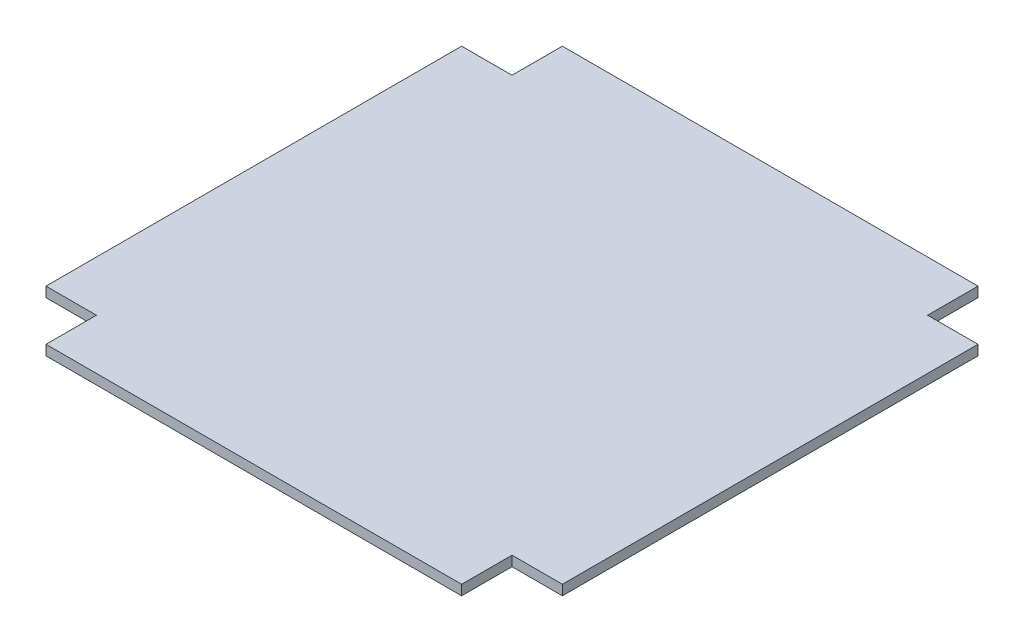
ISO-10303-21;
HEADER;
FILE_DESCRIPTION(('STEP AP214'),'2;1');
FILE_NAME('part.step','',(''),(''),'','','');
FILE_SCHEMA(('AUTOMOTIVE_DESIGN { 1 0 10303 214 1 1 1 1 }'));
ENDSEC;
DATA;
#1=APPLICATION_CONTEXT('core data for automotive mechanical design processes');
#2=APPLICATION_PROTOCOL_DEFINITION('international standard','automotive_design',2000,#1);
#3=PRODUCT_CONTEXT('',#1,'mechanical');
#4=PRODUCT('Part','Part','',(#3));
#5=PRODUCT_RELATED_PRODUCT_CATEGORY('part','',(#4));
#6=PRODUCT_DEFINITION_FORMATION('','',#4);
#7=PRODUCT_DEFINITION_CONTEXT('part definition',#1,'design');
#8=PRODUCT_DEFINITION('design','',#6,#7);
#9=PRODUCT_DEFINITION_SHAPE('','',#8);
#10=(LENGTH_UNIT() NAMED_UNIT(*) SI_UNIT(.MILLI.,.METRE.));
#11=(NAMED_UNIT(*) PLANE_ANGLE_UNIT() SI_UNIT($,.RADIAN.));
#12=(NAMED_UNIT(*) SI_UNIT($,.STERADIAN.) SOLID_ANGLE_UNIT());
#13=UNCERTAINTY_MEASURE_WITH_UNIT(LENGTH_MEASURE(1.E-05),#10,'distance_accuracy_value','');
#14=(GEOMETRIC_REPRESENTATION_CONTEXT(3) GLOBAL_UNCERTAINTY_ASSIGNED_CONTEXT((#13)) GLOBAL_UNIT_ASSIGNED_CONTEXT((#10,
#11,#12)) REPRESENTATION_CONTEXT('',''));
#15=CARTESIAN_POINT('',(0.,0.,0.));
#16=DIRECTION('',(0.,0.,1.));
#17=DIRECTION('',(1.,0.,0.));
#18=AXIS2_PLACEMENT_3D('',#15,#16,#17);
#19=CARTESIAN_POINT('',(0.,4.,-82.9));
#20=DIRECTION('',(0.,0.,-1.));
#21=DIRECTION('',(-1.,0.,0.));
#22=AXIS2_PLACEMENT_3D('',#19,#20,#21);
#23=PLANE('',#22);
#24=DIRECTION('',(1.,0.,0.));
#25=VECTOR('',#24,1.);
#26=CARTESIAN_POINT('',(0.,0.,-82.9));
#27=LINE('',#26,#25);
#28=CARTESIAN_POINT('',(-103.,0.,-82.9));
#29=VERTEX_POINT('',#28);
#30=CARTESIAN_POINT('',(-82.9,0.,-82.9));
#31=VERTEX_POINT('',#30);
#32=EDGE_CURVE('E153',#29,#31,#27,.T.);
#33=ORIENTED_EDGE('',*,*,#32,.F.);
#34=DIRECTION('',(0.,-1.,0.));
#35=VECTOR('',#34,1.);
#36=CARTESIAN_POINT('',(-103.,4.,-82.9));
#37=LINE('',#36,#35);
#38=CARTESIAN_POINT('',(-103.,4.,-82.9));
#39=VERTEX_POINT('',#38);
#40=EDGE_CURVE('E11',#39,#29,#37,.T.);
#41=ORIENTED_EDGE('',*,*,#40,.F.);
#42=DIRECTION('',(1.,0.,0.));
#43=VECTOR('',#42,1.);
#44=CARTESIAN_POINT('',(0.,4.,-82.9));
#45=LINE('',#44,#43);
#46=CARTESIAN_POINT('',(-82.9,4.,-82.9));
#47=VERTEX_POINT('',#46);
#48=EDGE_CURVE('E183',#39,#47,#45,.T.);
#49=ORIENTED_EDGE('',*,*,#48,.T.);
#50=DIRECTION('',(0.,-1.,0.));
#51=VECTOR('',#50,1.);
#52=CARTESIAN_POINT('',(-82.9,4.,-82.9));
#53=LINE('',#52,#51);
#54=EDGE_CURVE('E99',#47,#31,#53,.T.);
#55=ORIENTED_EDGE('',*,*,#54,.T.);
#56=EDGE_LOOP('',(#33,#41,#49,#55));
#57=FACE_BOUND('',#56,.T.);
#58=ADVANCED_FACE('F37',(#57),#23,.T.);
#59=CARTESIAN_POINT('',(-103.,4.,0.));
#60=DIRECTION('',(-1.,0.,0.));
#61=DIRECTION('',(0.,0.,1.));
#62=AXIS2_PLACEMENT_3D('',#59,#60,#61);
#63=PLANE('',#62);
#64=DIRECTION('',(0.,0.,-1.));
#65=VECTOR('',#64,1.);
#66=CARTESIAN_POINT('',(-103.,0.,0.));
#67=LINE('',#66,#65);
#68=CARTESIAN_POINT('',(-103.,0.,82.9));
#69=VERTEX_POINT('',#68);
#70=EDGE_CURVE('E156',#69,#29,#67,.T.);
#71=ORIENTED_EDGE('',*,*,#70,.F.);
#72=DIRECTION('',(0.,-1.,0.));
#73=VECTOR('',#72,1.);
#74=CARTESIAN_POINT('',(-103.,4.,82.9));
#75=LINE('',#74,#73);
#76=CARTESIAN_POINT('',(-103.,4.,82.9));
#77=VERTEX_POINT('',#76);
#78=EDGE_CURVE('E45',#77,#69,#75,.T.);
#79=ORIENTED_EDGE('',*,*,#78,.F.);
#80=DIRECTION('',(0.,0.,-1.));
#81=VECTOR('',#80,1.);
#82=CARTESIAN_POINT('',(-103.,4.,0.));
#83=LINE('',#82,#81);
#84=EDGE_CURVE('E215',#77,#39,#83,.T.);
#85=ORIENTED_EDGE('',*,*,#84,.T.);
#86=ORIENTED_EDGE('',*,*,#40,.T.);
#87=EDGE_LOOP('',(#71,#79,#85,#86));
#88=FACE_BOUND('',#87,.T.);
#89=ADVANCED_FACE('F214',(#88),#63,.T.);
#90=CARTESIAN_POINT('',(0.,4.,82.9));
#91=DIRECTION('',(0.,0.,-1.));
#92=DIRECTION('',(-1.,0.,0.));
#93=AXIS2_PLACEMENT_3D('',#90,#91,#92);
#94=PLANE('',#93);
#95=DIRECTION('',(1.,0.,0.));
#96=VECTOR('',#95,1.);
#97=CARTESIAN_POINT('',(0.,0.,82.9));
#98=LINE('',#97,#96);
#99=CARTESIAN_POINT('',(-82.9,0.,82.9));
#100=VERTEX_POINT('',#99);
#101=EDGE_CURVE('E159',#69,#100,#98,.T.);
#102=ORIENTED_EDGE('',*,*,#101,.T.);
#103=DIRECTION('',(0.,-1.,0.));
#104=VECTOR('',#103,1.);
#105=CARTESIAN_POINT('',(-82.9,4.,82.9));
#106=LINE('',#105,#104);
#107=CARTESIAN_POINT('',(-82.9,4.,82.9));
#108=VERTEX_POINT('',#107);
#109=EDGE_CURVE('E199',#108,#100,#106,.T.);
#110=ORIENTED_EDGE('',*,*,#109,.F.);
#111=DIRECTION('',(1.,0.,0.));
#112=VECTOR('',#111,1.);
#113=CARTESIAN_POINT('',(0.,4.,82.9));
#114=LINE('',#113,#112);
#115=EDGE_CURVE('E205',#77,#108,#114,.T.);
#116=ORIENTED_EDGE('',*,*,#115,.F.);
#117=ORIENTED_EDGE('',*,*,#78,.T.);
#118=EDGE_LOOP('',(#102,#110,#116,#117));
#119=FACE_BOUND('',#118,.T.);
#120=ADVANCED_FACE('F203',(#119),#94,.F.);
#121=CARTESIAN_POINT('',(-82.9,4.,0.));
#122=DIRECTION('',(-1.,0.,0.));
#123=DIRECTION('',(0.,0.,1.));
#124=AXIS2_PLACEMENT_3D('',#121,#122,#123);
#125=PLANE('',#124);
#126=DIRECTION('',(0.,0.,-1.));
#127=VECTOR('',#126,1.);
#128=CARTESIAN_POINT('',(-82.9,0.,0.));
#129=LINE('',#128,#127);
#130=CARTESIAN_POINT('',(-82.9,0.,103.));
#131=VERTEX_POINT('',#130);
#132=EDGE_CURVE('E162',#131,#100,#129,.T.);
#133=ORIENTED_EDGE('',*,*,#132,.F.);
#134=DIRECTION('',(0.,-1.,0.));
#135=VECTOR('',#134,1.);
#136=CARTESIAN_POINT('',(-82.9,4.,103.));
#137=LINE('',#136,#135);
#138=CARTESIAN_POINT('',(-82.9,4.,103.));
#139=VERTEX_POINT('',#138);
#140=EDGE_CURVE('E197',#139,#131,#137,.T.);
#141=ORIENTED_EDGE('',*,*,#140,.F.);
#142=DIRECTION('',(0.,0.,-1.));
#143=VECTOR('',#142,1.);
#144=CARTESIAN_POINT('',(-82.9,4.,0.));
#145=LINE('',#144,#143);
#146=EDGE_CURVE('E221',#139,#108,#145,.T.);
#147=ORIENTED_EDGE('',*,*,#146,.T.);
#148=ORIENTED_EDGE('',*,*,#109,.T.);
#149=EDGE_LOOP('',(#133,#141,#147,#148));
#150=FACE_BOUND('',#149,.T.);
#151=ADVANCED_FACE('F252',(#150),#125,.T.);
#152=CARTESIAN_POINT('',(0.,4.,103.));
#153=DIRECTION('',(0.,0.,-1.));
#154=DIRECTION('',(-1.,0.,0.));
#155=AXIS2_PLACEMENT_3D('',#152,#153,#154);
#156=PLANE('',#155);
#157=DIRECTION('',(1.,0.,0.));
#158=VECTOR('',#157,1.);
#159=CARTESIAN_POINT('',(0.,0.,103.));
#160=LINE('',#159,#158);
#161=CARTESIAN_POINT('',(82.9,0.,103.));
#162=VERTEX_POINT('',#161);
#163=EDGE_CURVE('E165',#131,#162,#160,.T.);
#164=ORIENTED_EDGE('',*,*,#163,.T.);
#165=DIRECTION('',(0.,-1.,0.));
#166=VECTOR('',#165,1.);
#167=CARTESIAN_POINT('',(82.9,4.,103.));
#168=LINE('',#167,#166);
#169=CARTESIAN_POINT('',(82.9,4.,103.));
#170=VERTEX_POINT('',#169);
#171=EDGE_CURVE('E194',#170,#162,#168,.T.);
#172=ORIENTED_EDGE('',*,*,#171,.F.);
#173=DIRECTION('',(1.,0.,0.));
#174=VECTOR('',#173,1.);
#175=CARTESIAN_POINT('',(0.,4.,103.));
#176=LINE('',#175,#174);
#177=EDGE_CURVE('E224',#139,#170,#176,.T.);
#178=ORIENTED_EDGE('',*,*,#177,.F.);
#179=ORIENTED_EDGE('',*,*,#140,.T.);
#180=EDGE_LOOP('',(#164,#172,#178,#179));
#181=FACE_BOUND('',#180,.T.);
#182=ADVANCED_FACE('F255',(#181),#156,.F.);
#183=CARTESIAN_POINT('',(82.9,4.,0.));
#184=DIRECTION('',(-1.,0.,0.));
#185=DIRECTION('',(0.,0.,1.));
#186=AXIS2_PLACEMENT_3D('',#183,#184,#185);
#187=PLANE('',#186);
#188=DIRECTION('',(0.,0.,-1.));
#189=VECTOR('',#188,1.);
#190=CARTESIAN_POINT('',(82.9,0.,0.));
#191=LINE('',#190,#189);
#192=CARTESIAN_POINT('',(82.9,0.,82.9));
#193=VERTEX_POINT('',#192);
#194=EDGE_CURVE('E167',#162,#193,#191,.T.);
#195=ORIENTED_EDGE('',*,*,#194,.T.);
#196=DIRECTION('',(0.,-1.,0.));
#197=VECTOR('',#196,1.);
#198=CARTESIAN_POINT('',(82.9,4.,82.9));
#199=LINE('',#198,#197);
#200=CARTESIAN_POINT('',(82.9,4.,82.9));
#201=VERTEX_POINT('',#200);
#202=EDGE_CURVE('E192',#201,#193,#199,.T.);
#203=ORIENTED_EDGE('',*,*,#202,.F.);
#204=DIRECTION('',(0.,0.,-1.));
#205=VECTOR('',#204,1.);
#206=CARTESIAN_POINT('',(82.9,4.,0.));
#207=LINE('',#206,#205);
#208=EDGE_CURVE('E226',#170,#201,#207,.T.);
#209=ORIENTED_EDGE('',*,*,#208,.F.);
#210=ORIENTED_EDGE('',*,*,#171,.T.);
#211=EDGE_LOOP('',(#195,#203,#209,#210));
#212=FACE_BOUND('',#211,.T.);
#213=ADVANCED_FACE('F248',(#212),#187,.F.);
#214=CARTESIAN_POINT('',(0.,4.,82.9));
#215=DIRECTION('',(0.,0.,1.));
#216=DIRECTION('',(1.,0.,0.));
#217=AXIS2_PLACEMENT_3D('',#214,#215,#216);
#218=PLANE('',#217);
#219=DIRECTION('',(-1.,0.,0.));
#220=VECTOR('',#219,1.);
#221=CARTESIAN_POINT('',(0.,0.,82.9));
#222=LINE('',#221,#220);
#223=CARTESIAN_POINT('',(103.,0.,82.9));
#224=VERTEX_POINT('',#223);
#225=EDGE_CURVE('E170',#224,#193,#222,.T.);
#226=ORIENTED_EDGE('',*,*,#225,.F.);
#227=DIRECTION('',(0.,-1.,0.));
#228=VECTOR('',#227,1.);
#229=CARTESIAN_POINT('',(103.,4.,82.9));
#230=LINE('',#229,#228);
#231=CARTESIAN_POINT('',(103.,4.,82.9));
#232=VERTEX_POINT('',#231);
#233=EDGE_CURVE('E190',#232,#224,#230,.T.);
#234=ORIENTED_EDGE('',*,*,#233,.F.);
#235=DIRECTION('',(-1.,0.,0.));
#236=VECTOR('',#235,1.);
#237=CARTESIAN_POINT('',(0.,4.,82.9));
#238=LINE('',#237,#236);
#239=EDGE_CURVE('E228',#232,#201,#238,.T.);
#240=ORIENTED_EDGE('',*,*,#239,.T.);
#241=ORIENTED_EDGE('',*,*,#202,.T.);
#242=EDGE_LOOP('',(#226,#234,#240,#241));
#243=FACE_BOUND('',#242,.T.);
#244=ADVANCED_FACE('F244',(#243),#218,.T.);
#245=CARTESIAN_POINT('',(103.,4.,0.));
#246=DIRECTION('',(-1.,0.,0.));
#247=DIRECTION('',(0.,0.,1.));
#248=AXIS2_PLACEMENT_3D('',#245,#246,#247);
#249=PLANE('',#248);
#250=DIRECTION('',(0.,0.,-1.));
#251=VECTOR('',#250,1.);
#252=CARTESIAN_POINT('',(103.,0.,0.));
#253=LINE('',#252,#251);
#254=CARTESIAN_POINT('',(103.,0.,-82.9));
#255=VERTEX_POINT('',#254);
#256=EDGE_CURVE('E173',#224,#255,#253,.T.);
#257=ORIENTED_EDGE('',*,*,#256,.T.);
#258=DIRECTION('',(0.,-1.,0.));
#259=VECTOR('',#258,1.);
#260=CARTESIAN_POINT('',(103.,4.,-82.9));
#261=LINE('',#260,#259);
#262=CARTESIAN_POINT('',(103.,4.,-82.9));
#263=VERTEX_POINT('',#262);
#264=EDGE_CURVE('E187',#263,#255,#261,.T.);
#265=ORIENTED_EDGE('',*,*,#264,.F.);
#266=DIRECTION('',(0.,0.,-1.));
#267=VECTOR('',#266,1.);
#268=CARTESIAN_POINT('',(103.,4.,0.));
#269=LINE('',#268,#267);
#270=EDGE_CURVE('E231',#232,#263,#269,.T.);
#271=ORIENTED_EDGE('',*,*,#270,.F.);
#272=ORIENTED_EDGE('',*,*,#233,.T.);
#273=EDGE_LOOP('',(#257,#265,#271,#272));
#274=FACE_BOUND('',#273,.T.);
#275=ADVANCED_FACE('F236',(#274),#249,.F.);
#276=CARTESIAN_POINT('',(0.,4.,-82.9));
#277=DIRECTION('',(0.,0.,1.));
#278=DIRECTION('',(1.,0.,0.));
#279=AXIS2_PLACEMENT_3D('',#276,#277,#278);
#280=PLANE('',#279);
#281=DIRECTION('',(-1.,0.,0.));
#282=VECTOR('',#281,1.);
#283=CARTESIAN_POINT('',(0.,0.,-82.9));
#284=LINE('',#283,#282);
#285=CARTESIAN_POINT('',(82.9,0.,-82.9));
#286=VERTEX_POINT('',#285);
#287=EDGE_CURVE('E175',#255,#286,#284,.T.);
#288=ORIENTED_EDGE('',*,*,#287,.T.);
#289=DIRECTION('',(0.,-1.,0.));
#290=VECTOR('',#289,1.);
#291=CARTESIAN_POINT('',(82.9,4.,-82.9));
#292=LINE('',#291,#290);
#293=CARTESIAN_POINT('',(82.9,4.,-82.9));
#294=VERTEX_POINT('',#293);
#295=EDGE_CURVE('E140',#294,#286,#292,.T.);
#296=ORIENTED_EDGE('',*,*,#295,.F.);
#297=DIRECTION('',(-1.,0.,0.));
#298=VECTOR('',#297,1.);
#299=CARTESIAN_POINT('',(0.,4.,-82.9));
#300=LINE('',#299,#298);
#301=EDGE_CURVE('E145',#263,#294,#300,.T.);
#302=ORIENTED_EDGE('',*,*,#301,.F.);
#303=ORIENTED_EDGE('',*,*,#264,.T.);
#304=EDGE_LOOP('',(#288,#296,#302,#303));
#305=FACE_BOUND('',#304,.T.);
#306=ADVANCED_FACE('F240',(#305),#280,.F.);
#307=CARTESIAN_POINT('',(82.9,4.,0.));
#308=DIRECTION('',(1.,0.,0.));
#309=DIRECTION('',(0.,0.,-1.));
#310=AXIS2_PLACEMENT_3D('',#307,#308,#309);
#311=PLANE('',#310);
#312=DIRECTION('',(0.,0.,1.));
#313=VECTOR('',#312,1.);
#314=CARTESIAN_POINT('',(82.9,0.,0.));
#315=LINE('',#314,#313);
#316=CARTESIAN_POINT('',(82.9,0.,-103.));
#317=VERTEX_POINT('',#316);
#318=EDGE_CURVE('E135',#317,#286,#315,.T.);
#319=ORIENTED_EDGE('',*,*,#318,.F.);
#320=DIRECTION('',(0.,-1.,0.));
#321=VECTOR('',#320,1.);
#322=CARTESIAN_POINT('',(82.9,4.,-103.));
#323=LINE('',#322,#321);
#324=CARTESIAN_POINT('',(82.9,4.,-103.));
#325=VERTEX_POINT('',#324);
#326=EDGE_CURVE('E130',#325,#317,#323,.T.);
#327=ORIENTED_EDGE('',*,*,#326,.F.);
#328=DIRECTION('',(0.,0.,1.));
#329=VECTOR('',#328,1.);
#330=CARTESIAN_POINT('',(82.9,4.,0.));
#331=LINE('',#330,#329);
#332=EDGE_CURVE('E133',#325,#294,#331,.T.);
#333=ORIENTED_EDGE('',*,*,#332,.T.);
#334=ORIENTED_EDGE('',*,*,#295,.T.);
#335=EDGE_LOOP('',(#319,#327,#333,#334));
#336=FACE_BOUND('',#335,.T.);
#337=ADVANCED_FACE('F132',(#336),#311,.T.);
#338=CARTESIAN_POINT('',(0.,4.,-103.));
#339=DIRECTION('',(0.,0.,-1.));
#340=DIRECTION('',(-1.,0.,0.));
#341=AXIS2_PLACEMENT_3D('',#338,#339,#340);
#342=PLANE('',#341);
#343=DIRECTION('',(1.,0.,0.));
#344=VECTOR('',#343,1.);
#345=CARTESIAN_POINT('',(0.,0.,-103.));
#346=LINE('',#345,#344);
#347=CARTESIAN_POINT('',(-82.9,0.,-103.));
#348=VERTEX_POINT('',#347);
#349=EDGE_CURVE('E179',#348,#317,#346,.T.);
#350=ORIENTED_EDGE('',*,*,#349,.F.);
#351=DIRECTION('',(0.,-1.,0.));
#352=VECTOR('',#351,1.);
#353=CARTESIAN_POINT('',(-82.9,4.,-103.));
#354=LINE('',#353,#352);
#355=CARTESIAN_POINT('',(-82.9,4.,-103.));
#356=VERTEX_POINT('',#355);
#357=EDGE_CURVE('E92',#356,#348,#354,.T.);
#358=ORIENTED_EDGE('',*,*,#357,.F.);
#359=DIRECTION('',(1.,0.,0.));
#360=VECTOR('',#359,1.);
#361=CARTESIAN_POINT('',(0.,4.,-103.));
#362=LINE('',#361,#360);
#363=EDGE_CURVE('E143',#356,#325,#362,.T.);
#364=ORIENTED_EDGE('',*,*,#363,.T.);
#365=ORIENTED_EDGE('',*,*,#326,.T.);
#366=EDGE_LOOP('',(#350,#358,#364,#365));
#367=FACE_BOUND('',#366,.T.);
#368=ADVANCED_FACE('F148',(#367),#342,.T.);
#369=CARTESIAN_POINT('',(-82.9,4.,0.));
#370=DIRECTION('',(1.,0.,0.));
#371=DIRECTION('',(0.,0.,-1.));
#372=AXIS2_PLACEMENT_3D('',#369,#370,#371);
#373=PLANE('',#372);
#374=DIRECTION('',(0.,0.,1.));
#375=VECTOR('',#374,1.);
#376=CARTESIAN_POINT('',(-82.9,0.,0.));
#377=LINE('',#376,#375);
#378=EDGE_CURVE('E181',#348,#31,#377,.T.);
#379=ORIENTED_EDGE('',*,*,#378,.T.);
#380=ORIENTED_EDGE('',*,*,#54,.F.);
#381=DIRECTION('',(0.,0.,1.));
#382=VECTOR('',#381,1.);
#383=CARTESIAN_POINT('',(-82.9,4.,0.));
#384=LINE('',#383,#382);
#385=EDGE_CURVE('E53',#356,#47,#384,.T.);
#386=ORIENTED_EDGE('',*,*,#385,.F.);
#387=ORIENTED_EDGE('',*,*,#357,.T.);
#388=EDGE_LOOP('',(#379,#380,#386,#387));
#389=FACE_BOUND('',#388,.T.);
#390=ADVANCED_FACE('F216',(#389),#373,.F.);
#391=CARTESIAN_POINT('',(0.,4.,0.));
#392=DIRECTION('',(0.,1.,0.));
#393=DIRECTION('',(0.,0.,1.));
#394=AXIS2_PLACEMENT_3D('',#391,#392,#393);
#395=PLANE('',#394);
#396=ORIENTED_EDGE('',*,*,#48,.F.);
#397=ORIENTED_EDGE('',*,*,#84,.F.);
#398=ORIENTED_EDGE('',*,*,#115,.T.);
#399=ORIENTED_EDGE('',*,*,#146,.F.);
#400=ORIENTED_EDGE('',*,*,#177,.T.);
#401=ORIENTED_EDGE('',*,*,#208,.T.);
#402=ORIENTED_EDGE('',*,*,#239,.F.);
#403=ORIENTED_EDGE('',*,*,#270,.T.);
#404=ORIENTED_EDGE('',*,*,#301,.T.);
#405=ORIENTED_EDGE('',*,*,#332,.F.);
#406=ORIENTED_EDGE('',*,*,#363,.F.);
#407=ORIENTED_EDGE('',*,*,#385,.T.);
#408=EDGE_LOOP('',(#396,#397,#398,#399,#400,#401,#402,#403,#404,#405,#406,#407));
#409=FACE_BOUND('',#408,.T.);
#410=ADVANCED_FACE('F142',(#409),#395,.T.);
#411=CARTESIAN_POINT('',(0.,0.,0.));
#412=DIRECTION('',(0.,1.,0.));
#413=DIRECTION('',(0.,0.,1.));
#414=AXIS2_PLACEMENT_3D('',#411,#412,#413);
#415=PLANE('',#414);
#416=ORIENTED_EDGE('',*,*,#32,.T.);
#417=ORIENTED_EDGE('',*,*,#378,.F.);
#418=ORIENTED_EDGE('',*,*,#349,.T.);
#419=ORIENTED_EDGE('',*,*,#318,.T.);
#420=ORIENTED_EDGE('',*,*,#287,.F.);
#421=ORIENTED_EDGE('',*,*,#256,.F.);
#422=ORIENTED_EDGE('',*,*,#225,.T.);
#423=ORIENTED_EDGE('',*,*,#194,.F.);
#424=ORIENTED_EDGE('',*,*,#163,.F.);
#425=ORIENTED_EDGE('',*,*,#132,.T.);
#426=ORIENTED_EDGE('',*,*,#101,.F.);
#427=ORIENTED_EDGE('',*,*,#70,.T.);
#428=EDGE_LOOP('',(#416,#417,#418,#419,#420,#421,#422,#423,#424,#425,#426,#427));
#429=FACE_BOUND('',#428,.T.);
#430=ADVANCED_FACE('F211',(#429),#415,.F.);
#431=CLOSED_SHELL('',(#58,#89,#120,#151,#182,#213,#244,#275,#306,#337,#368,#390,#410,#430));
#432=MANIFOLD_SOLID_BREP('B2',#431);
#433=ADVANCED_BREP_SHAPE_REPRESENTATION('',(#18,#432),#14);
#434=SHAPE_DEFINITION_REPRESENTATION(#9,#433);
ENDSEC;
END-ISO-10303-21;
